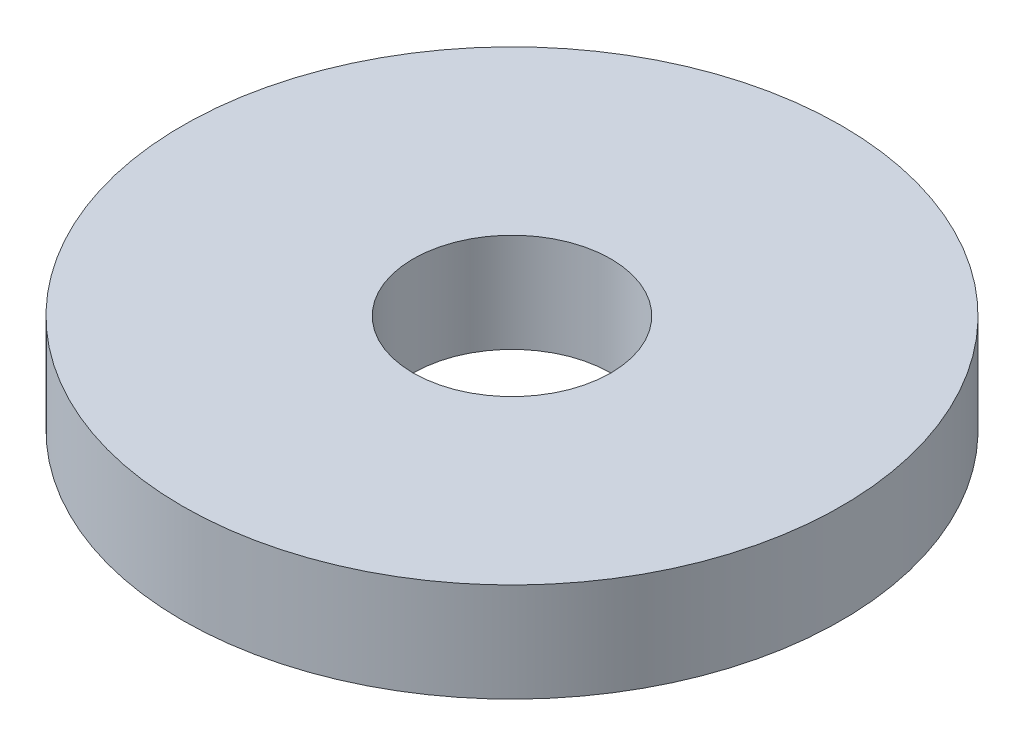
ISO-10303-21;
HEADER;
FILE_DESCRIPTION(('STEP AP214'),'2;1');
FILE_NAME('part.step','',(''),(''),'','','');
FILE_SCHEMA(('AUTOMOTIVE_DESIGN { 1 0 10303 214 1 1 1 1 }'));
ENDSEC;
DATA;
#1=APPLICATION_CONTEXT('core data for automotive mechanical design processes');
#2=APPLICATION_PROTOCOL_DEFINITION('international standard','automotive_design',2000,#1);
#3=PRODUCT_CONTEXT('',#1,'mechanical');
#4=PRODUCT('Part','Part','',(#3));
#5=PRODUCT_RELATED_PRODUCT_CATEGORY('part','',(#4));
#6=PRODUCT_DEFINITION_FORMATION('','',#4);
#7=PRODUCT_DEFINITION_CONTEXT('part definition',#1,'design');
#8=PRODUCT_DEFINITION('design','',#6,#7);
#9=PRODUCT_DEFINITION_SHAPE('','',#8);
#10=(LENGTH_UNIT() NAMED_UNIT(*) SI_UNIT(.MILLI.,.METRE.));
#11=(NAMED_UNIT(*) PLANE_ANGLE_UNIT() SI_UNIT($,.RADIAN.));
#12=(NAMED_UNIT(*) SI_UNIT($,.STERADIAN.) SOLID_ANGLE_UNIT());
#13=UNCERTAINTY_MEASURE_WITH_UNIT(LENGTH_MEASURE(1.E-05),#10,'distance_accuracy_value','');
#14=(GEOMETRIC_REPRESENTATION_CONTEXT(3) GLOBAL_UNCERTAINTY_ASSIGNED_CONTEXT((#13)) GLOBAL_UNIT_ASSIGNED_CONTEXT((#10,
#11,#12)) REPRESENTATION_CONTEXT('',''));
#15=CARTESIAN_POINT('',(0.,0.,0.));
#16=DIRECTION('',(0.,0.,1.));
#17=DIRECTION('',(1.,0.,0.));
#18=AXIS2_PLACEMENT_3D('',#15,#16,#17);
#19=CARTESIAN_POINT('',(0.,1.5,0.));
#20=DIRECTION('',(0.,1.,0.));
#21=DIRECTION('',(0.,0.,1.));
#22=AXIS2_PLACEMENT_3D('',#19,#20,#21);
#23=PLANE('',#22);
#24=CARTESIAN_POINT('',(0.,1.5,0.));
#25=DIRECTION('',(0.,1.,0.));
#26=DIRECTION('',(0.,0.,1.));
#27=AXIS2_PLACEMENT_3D('',#24,#25,#26);
#28=CIRCLE('',#27,5.);
#29=CARTESIAN_POINT('',(0.,1.5,5.));
#30=VERTEX_POINT('',#29);
#31=EDGE_CURVE('E10',#30,#30,#28,.T.);
#32=ORIENTED_EDGE('',*,*,#31,.T.);
#33=EDGE_LOOP('',(#32));
#34=FACE_BOUND('',#33,.T.);
#35=CARTESIAN_POINT('',(0.,1.5,0.));
#36=DIRECTION('',(0.,1.,0.));
#37=DIRECTION('',(0.,0.,1.));
#38=AXIS2_PLACEMENT_3D('',#35,#36,#37);
#39=CIRCLE('',#38,1.5);
#40=CARTESIAN_POINT('',(0.,1.5,1.5));
#41=VERTEX_POINT('',#40);
#42=EDGE_CURVE('E50',#41,#41,#39,.T.);
#43=ORIENTED_EDGE('',*,*,#42,.F.);
#44=EDGE_LOOP('',(#43));
#45=FACE_BOUND('',#44,.T.);
#46=ADVANCED_FACE('F37',(#34,#45),#23,.T.);
#47=CARTESIAN_POINT('',(0.,0.,0.));
#48=DIRECTION('',(0.,1.,0.));
#49=DIRECTION('',(0.,0.,1.));
#50=AXIS2_PLACEMENT_3D('',#47,#48,#49);
#51=PLANE('',#50);
#52=CARTESIAN_POINT('',(0.,0.,0.));
#53=DIRECTION('',(0.,1.,0.));
#54=DIRECTION('',(0.,0.,1.));
#55=AXIS2_PLACEMENT_3D('',#52,#53,#54);
#56=CIRCLE('',#55,5.);
#57=CARTESIAN_POINT('',(0.,0.,5.));
#58=VERTEX_POINT('',#57);
#59=EDGE_CURVE('E41',#58,#58,#56,.T.);
#60=ORIENTED_EDGE('',*,*,#59,.F.);
#61=EDGE_LOOP('',(#60));
#62=FACE_BOUND('',#61,.T.);
#63=CARTESIAN_POINT('',(0.,0.,0.));
#64=DIRECTION('',(0.,1.,0.));
#65=DIRECTION('',(0.,0.,1.));
#66=AXIS2_PLACEMENT_3D('',#63,#64,#65);
#67=CIRCLE('',#66,1.5);
#68=CARTESIAN_POINT('',(0.,0.,1.5));
#69=VERTEX_POINT('',#68);
#70=EDGE_CURVE('E52',#69,#69,#67,.T.);
#71=ORIENTED_EDGE('',*,*,#70,.T.);
#72=EDGE_LOOP('',(#71));
#73=FACE_BOUND('',#72,.T.);
#74=ADVANCED_FACE('F64',(#62,#73),#51,.F.);
#75=CARTESIAN_POINT('',(0.,1.5,0.));
#76=DIRECTION('',(0.,-1.,0.));
#77=DIRECTION('',(0.,0.,-1.));
#78=AXIS2_PLACEMENT_3D('',#75,#76,#77);
#79=CYLINDRICAL_SURFACE('',#78,5.);
#80=ORIENTED_EDGE('',*,*,#31,.F.);
#81=EDGE_LOOP('',(#80));
#82=FACE_BOUND('',#81,.T.);
#83=ORIENTED_EDGE('',*,*,#59,.T.);
#84=EDGE_LOOP('',(#83));
#85=FACE_BOUND('',#84,.T.);
#86=ADVANCED_FACE('F39',(#82,#85),#79,.T.);
#87=CARTESIAN_POINT('',(0.,1.5,0.));
#88=DIRECTION('',(0.,-1.,0.));
#89=DIRECTION('',(0.,0.,-1.));
#90=AXIS2_PLACEMENT_3D('',#87,#88,#89);
#91=CYLINDRICAL_SURFACE('',#90,1.5);
#92=ORIENTED_EDGE('',*,*,#42,.T.);
#93=EDGE_LOOP('',(#92));
#94=FACE_BOUND('',#93,.T.);
#95=ORIENTED_EDGE('',*,*,#70,.F.);
#96=EDGE_LOOP('',(#95));
#97=FACE_BOUND('',#96,.T.);
#98=ADVANCED_FACE('F60',(#94,#97),#91,.F.);
#99=CLOSED_SHELL('',(#46,#74,#86,#98));
#100=MANIFOLD_SOLID_BREP('B2',#99);
#101=ADVANCED_BREP_SHAPE_REPRESENTATION('',(#18,#100),#14);
#102=SHAPE_DEFINITION_REPRESENTATION(#9,#101);
ENDSEC;
END-ISO-10303-21;
